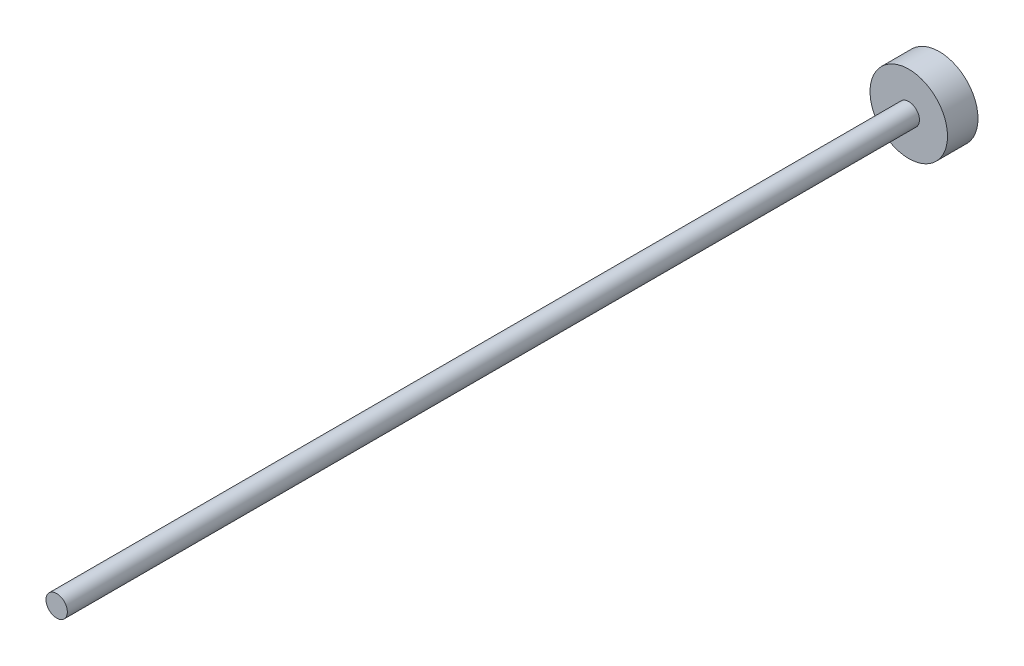
ISO-10303-21;
HEADER;
FILE_DESCRIPTION(('STEP AP214'),'2;1');
FILE_NAME('part.step','',(''),(''),'','','');
FILE_SCHEMA(('AUTOMOTIVE_DESIGN { 1 0 10303 214 1 1 1 1 }'));
ENDSEC;
DATA;
#1=APPLICATION_CONTEXT('core data for automotive mechanical design processes');
#2=APPLICATION_PROTOCOL_DEFINITION('international standard','automotive_design',2000,#1);
#3=PRODUCT_CONTEXT('',#1,'mechanical');
#4=PRODUCT('Part','Part','',(#3));
#5=PRODUCT_RELATED_PRODUCT_CATEGORY('part','',(#4));
#6=PRODUCT_DEFINITION_FORMATION('','',#4);
#7=PRODUCT_DEFINITION_CONTEXT('part definition',#1,'design');
#8=PRODUCT_DEFINITION('design','',#6,#7);
#9=PRODUCT_DEFINITION_SHAPE('','',#8);
#10=(LENGTH_UNIT() NAMED_UNIT(*) SI_UNIT(.MILLI.,.METRE.));
#11=(NAMED_UNIT(*) PLANE_ANGLE_UNIT() SI_UNIT($,.RADIAN.));
#12=(NAMED_UNIT(*) SI_UNIT($,.STERADIAN.) SOLID_ANGLE_UNIT());
#13=UNCERTAINTY_MEASURE_WITH_UNIT(LENGTH_MEASURE(1.E-05),#10,'distance_accuracy_value','');
#14=(GEOMETRIC_REPRESENTATION_CONTEXT(3) GLOBAL_UNCERTAINTY_ASSIGNED_CONTEXT((#13)) GLOBAL_UNIT_ASSIGNED_CONTEXT((#10,
#11,#12)) REPRESENTATION_CONTEXT('',''));
#15=CARTESIAN_POINT('',(0.,0.,0.));
#16=DIRECTION('',(0.,0.,1.));
#17=DIRECTION('',(1.,0.,0.));
#18=AXIS2_PLACEMENT_3D('',#15,#16,#17);
#19=CARTESIAN_POINT('',(0.,0.,69.85));
#20=DIRECTION('',(0.,0.,-1.));
#21=DIRECTION('',(-1.,0.,0.));
#22=AXIS2_PLACEMENT_3D('',#19,#20,#21);
#23=CYLINDRICAL_SURFACE('',#22,0.8763);
#24=CARTESIAN_POINT('',(0.,0.,69.85));
#25=DIRECTION('',(0.,0.,1.));
#26=DIRECTION('',(1.,0.,0.));
#27=AXIS2_PLACEMENT_3D('',#24,#25,#26);
#28=CIRCLE('',#27,0.8763);
#29=CARTESIAN_POINT('',(0.8763,0.,69.85));
#30=VERTEX_POINT('',#29);
#31=EDGE_CURVE('E10',#30,#30,#28,.T.);
#32=ORIENTED_EDGE('',*,*,#31,.F.);
#33=EDGE_LOOP('',(#32));
#34=FACE_BOUND('',#33,.T.);
#35=CARTESIAN_POINT('',(0.,0.,0.));
#36=DIRECTION('',(0.,0.,1.));
#37=DIRECTION('',(1.,0.,0.));
#38=AXIS2_PLACEMENT_3D('',#35,#36,#37);
#39=CIRCLE('',#38,0.8763);
#40=CARTESIAN_POINT('',(0.8763,0.,0.));
#41=VERTEX_POINT('',#40);
#42=EDGE_CURVE('E37',#41,#41,#39,.T.);
#43=ORIENTED_EDGE('',*,*,#42,.T.);
#44=EDGE_LOOP('',(#43));
#45=FACE_BOUND('',#44,.T.);
#46=ADVANCED_FACE('F31',(#34,#45),#23,.T.);
#47=CARTESIAN_POINT('',(0.,0.,69.85));
#48=DIRECTION('',(0.,0.,1.));
#49=DIRECTION('',(1.,0.,0.));
#50=AXIS2_PLACEMENT_3D('',#47,#48,#49);
#51=PLANE('',#50);
#52=ORIENTED_EDGE('',*,*,#31,.T.);
#53=EDGE_LOOP('',(#52));
#54=FACE_BOUND('',#53,.T.);
#55=ADVANCED_FACE('F65',(#54),#51,.T.);
#56=CARTESIAN_POINT('',(0.,0.,0.));
#57=DIRECTION('',(0.,0.,1.));
#58=DIRECTION('',(1.,0.,0.));
#59=AXIS2_PLACEMENT_3D('',#56,#57,#58);
#60=PLANE('',#59);
#61=CARTESIAN_POINT('',(0.,0.,0.));
#62=DIRECTION('',(0.,0.,1.));
#63=DIRECTION('',(1.,0.,0.));
#64=AXIS2_PLACEMENT_3D('',#61,#62,#63);
#65=CIRCLE('',#64,3.175);
#66=CARTESIAN_POINT('',(3.175,0.,0.));
#67=VERTEX_POINT('',#66);
#68=EDGE_CURVE('E45',#67,#67,#65,.T.);
#69=ORIENTED_EDGE('',*,*,#68,.T.);
#70=EDGE_LOOP('',(#69));
#71=FACE_BOUND('',#70,.T.);
#72=ORIENTED_EDGE('',*,*,#42,.F.);
#73=EDGE_LOOP('',(#72));
#74=FACE_BOUND('',#73,.T.);
#75=ADVANCED_FACE('F51',(#71,#74),#60,.T.);
#76=CARTESIAN_POINT('',(0.,0.,-2.5));
#77=DIRECTION('',(0.,0.,1.));
#78=DIRECTION('',(1.,0.,0.));
#79=AXIS2_PLACEMENT_3D('',#76,#77,#78);
#80=CYLINDRICAL_SURFACE('',#79,3.175);
#81=CARTESIAN_POINT('',(0.,0.,-2.5));
#82=DIRECTION('',(0.,0.,1.));
#83=DIRECTION('',(1.,0.,0.));
#84=AXIS2_PLACEMENT_3D('',#81,#82,#83);
#85=CIRCLE('',#84,3.175);
#86=CARTESIAN_POINT('',(3.175,0.,-2.5));
#87=VERTEX_POINT('',#86);
#88=EDGE_CURVE('E41',#87,#87,#85,.T.);
#89=ORIENTED_EDGE('',*,*,#88,.T.);
#90=EDGE_LOOP('',(#89));
#91=FACE_BOUND('',#90,.T.);
#92=ORIENTED_EDGE('',*,*,#68,.F.);
#93=EDGE_LOOP('',(#92));
#94=FACE_BOUND('',#93,.T.);
#95=ADVANCED_FACE('F54',(#91,#94),#80,.T.);
#96=CARTESIAN_POINT('',(0.,0.,-2.5));
#97=DIRECTION('',(0.,0.,1.));
#98=DIRECTION('',(1.,0.,0.));
#99=AXIS2_PLACEMENT_3D('',#96,#97,#98);
#100=PLANE('',#99);
#101=ORIENTED_EDGE('',*,*,#88,.F.);
#102=EDGE_LOOP('',(#101));
#103=FACE_BOUND('',#102,.T.);
#104=ADVANCED_FACE('F56',(#103),#100,.F.);
#105=CLOSED_SHELL('',(#46,#55,#75,#95,#104));
#106=MANIFOLD_SOLID_BREP('B2',#105);
#107=ADVANCED_BREP_SHAPE_REPRESENTATION('',(#18,#106),#14);
#108=SHAPE_DEFINITION_REPRESENTATION(#9,#107);
ENDSEC;
END-ISO-10303-21;
